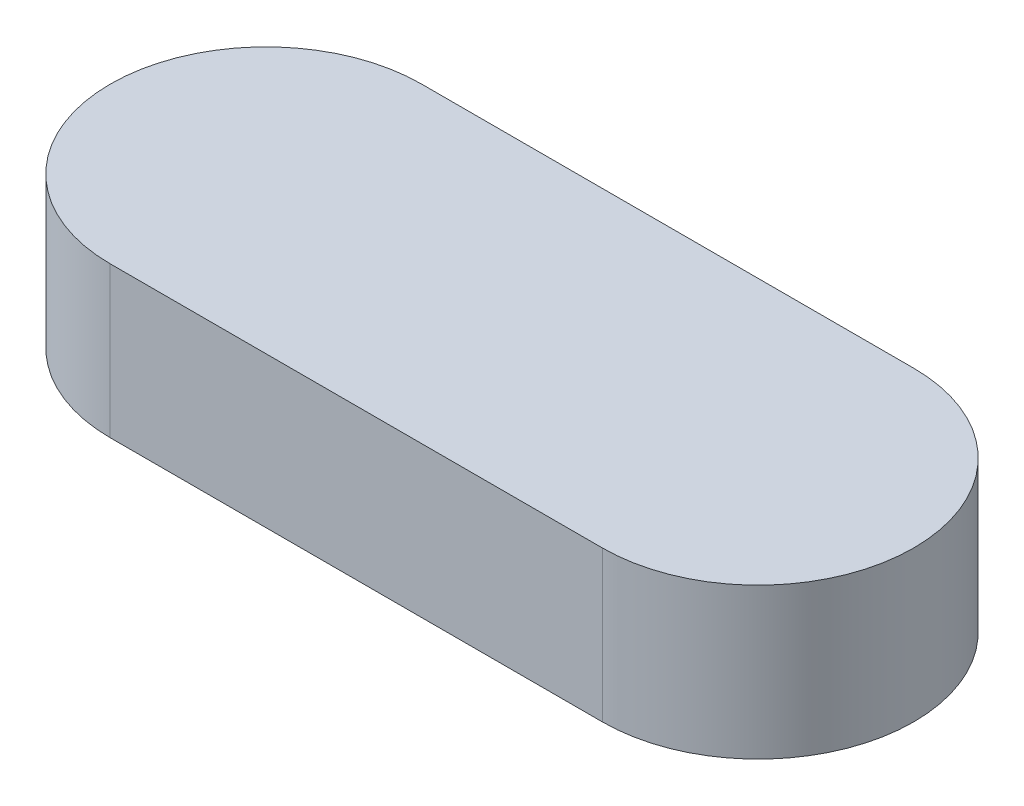
ISO-10303-21;
HEADER;
FILE_DESCRIPTION(('STEP AP214'),'2;1');
FILE_NAME('part.step','',(''),(''),'','','');
FILE_SCHEMA(('AUTOMOTIVE_DESIGN { 1 0 10303 214 1 1 1 1 }'));
ENDSEC;
DATA;
#1=APPLICATION_CONTEXT('core data for automotive mechanical design processes');
#2=APPLICATION_PROTOCOL_DEFINITION('international standard','automotive_design',2000,#1);
#3=PRODUCT_CONTEXT('',#1,'mechanical');
#4=PRODUCT('Part','Part','',(#3));
#5=PRODUCT_RELATED_PRODUCT_CATEGORY('part','',(#4));
#6=PRODUCT_DEFINITION_FORMATION('','',#4);
#7=PRODUCT_DEFINITION_CONTEXT('part definition',#1,'design');
#8=PRODUCT_DEFINITION('design','',#6,#7);
#9=PRODUCT_DEFINITION_SHAPE('','',#8);
#10=(LENGTH_UNIT() NAMED_UNIT(*) SI_UNIT(.MILLI.,.METRE.));
#11=(NAMED_UNIT(*) PLANE_ANGLE_UNIT() SI_UNIT($,.RADIAN.));
#12=(NAMED_UNIT(*) SI_UNIT($,.STERADIAN.) SOLID_ANGLE_UNIT());
#13=UNCERTAINTY_MEASURE_WITH_UNIT(LENGTH_MEASURE(1.E-05),#10,'distance_accuracy_value','');
#14=(GEOMETRIC_REPRESENTATION_CONTEXT(3) GLOBAL_UNCERTAINTY_ASSIGNED_CONTEXT((#13)) GLOBAL_UNIT_ASSIGNED_CONTEXT((#10,
#11,#12)) REPRESENTATION_CONTEXT('',''));
#15=CARTESIAN_POINT('',(0.,0.,0.));
#16=DIRECTION('',(0.,0.,1.));
#17=DIRECTION('',(1.,0.,0.));
#18=AXIS2_PLACEMENT_3D('',#15,#16,#17);
#19=CARTESIAN_POINT('',(-12.25,7.5,0.));
#20=DIRECTION('',(0.,-1.,0.));
#21=DIRECTION('',(0.,0.,-1.));
#22=AXIS2_PLACEMENT_3D('',#19,#20,#21);
#23=CYLINDRICAL_SURFACE('',#22,7.75);
#24=CARTESIAN_POINT('',(-12.25,0.,0.));
#25=DIRECTION('',(0.,1.,0.));
#26=DIRECTION('',(0.,0.,1.));
#27=AXIS2_PLACEMENT_3D('',#24,#25,#26);
#28=CIRCLE('',#27,7.75);
#29=CARTESIAN_POINT('',(-12.25,0.,-7.75));
#30=VERTEX_POINT('',#29);
#31=CARTESIAN_POINT('',(-12.25,0.,7.75));
#32=VERTEX_POINT('',#31);
#33=EDGE_CURVE('E111',#30,#32,#28,.T.);
#34=ORIENTED_EDGE('',*,*,#33,.T.);
#35=DIRECTION('',(0.,-1.,0.));
#36=VECTOR('',#35,1.);
#37=CARTESIAN_POINT('',(-12.25,7.5,7.75));
#38=LINE('',#37,#36);
#39=CARTESIAN_POINT('',(-12.25,7.5,7.75));
#40=VERTEX_POINT('',#39);
#41=EDGE_CURVE('E11',#40,#32,#38,.T.);
#42=ORIENTED_EDGE('',*,*,#41,.F.);
#43=CARTESIAN_POINT('',(-12.25,7.5,0.));
#44=DIRECTION('',(0.,1.,0.));
#45=DIRECTION('',(0.,0.,1.));
#46=AXIS2_PLACEMENT_3D('',#43,#44,#45);
#47=CIRCLE('',#46,7.75);
#48=CARTESIAN_POINT('',(-12.25,7.5,-7.75));
#49=VERTEX_POINT('',#48);
#50=EDGE_CURVE('E95',#49,#40,#47,.T.);
#51=ORIENTED_EDGE('',*,*,#50,.F.);
#52=DIRECTION('',(0.,-1.,0.));
#53=VECTOR('',#52,1.);
#54=CARTESIAN_POINT('',(-12.25,7.5,-7.75));
#55=LINE('',#54,#53);
#56=EDGE_CURVE('E107',#49,#30,#55,.T.);
#57=ORIENTED_EDGE('',*,*,#56,.T.);
#58=EDGE_LOOP('',(#34,#42,#51,#57));
#59=FACE_BOUND('',#58,.T.);
#60=ADVANCED_FACE('F43',(#59),#23,.T.);
#61=CARTESIAN_POINT('',(-12.25,7.5,7.75));
#62=DIRECTION('',(0.,0.,-1.));
#63=DIRECTION('',(-1.,0.,0.));
#64=AXIS2_PLACEMENT_3D('',#61,#62,#63);
#65=PLANE('',#64);
#66=DIRECTION('',(1.,0.,0.));
#67=VECTOR('',#66,1.);
#68=CARTESIAN_POINT('',(-12.25,0.,7.75));
#69=LINE('',#68,#67);
#70=CARTESIAN_POINT('',(12.25,0.,7.75));
#71=VERTEX_POINT('',#70);
#72=EDGE_CURVE('E100',#32,#71,#69,.T.);
#73=ORIENTED_EDGE('',*,*,#72,.T.);
#74=DIRECTION('',(0.,-1.,0.));
#75=VECTOR('',#74,1.);
#76=CARTESIAN_POINT('',(12.25,7.5,7.75));
#77=LINE('',#76,#75);
#78=CARTESIAN_POINT('',(12.25,7.5,7.75));
#79=VERTEX_POINT('',#78);
#80=EDGE_CURVE('E52',#79,#71,#77,.T.);
#81=ORIENTED_EDGE('',*,*,#80,.F.);
#82=DIRECTION('',(1.,0.,0.));
#83=VECTOR('',#82,1.);
#84=CARTESIAN_POINT('',(-12.25,7.5,7.75));
#85=LINE('',#84,#83);
#86=EDGE_CURVE('E90',#40,#79,#85,.T.);
#87=ORIENTED_EDGE('',*,*,#86,.F.);
#88=ORIENTED_EDGE('',*,*,#41,.T.);
#89=EDGE_LOOP('',(#73,#81,#87,#88));
#90=FACE_BOUND('',#89,.T.);
#91=ADVANCED_FACE('F99',(#90),#65,.F.);
#92=CARTESIAN_POINT('',(12.25,7.5,0.));
#93=DIRECTION('',(0.,-1.,0.));
#94=DIRECTION('',(0.,0.,-1.));
#95=AXIS2_PLACEMENT_3D('',#92,#93,#94);
#96=CYLINDRICAL_SURFACE('',#95,7.75);
#97=CARTESIAN_POINT('',(12.25,0.,0.));
#98=DIRECTION('',(0.,1.,0.));
#99=DIRECTION('',(0.,0.,1.));
#100=AXIS2_PLACEMENT_3D('',#97,#98,#99);
#101=CIRCLE('',#100,7.75);
#102=CARTESIAN_POINT('',(12.25,0.,-7.75000000000001));
#103=VERTEX_POINT('',#102);
#104=EDGE_CURVE('E77',#71,#103,#101,.T.);
#105=ORIENTED_EDGE('',*,*,#104,.T.);
#106=DIRECTION('',(0.,-1.,0.));
#107=VECTOR('',#106,1.);
#108=CARTESIAN_POINT('',(12.25,7.5,-7.75000000000001));
#109=LINE('',#108,#107);
#110=CARTESIAN_POINT('',(12.25,7.5,-7.75000000000001));
#111=VERTEX_POINT('',#110);
#112=EDGE_CURVE('E102',#111,#103,#109,.T.);
#113=ORIENTED_EDGE('',*,*,#112,.F.);
#114=CARTESIAN_POINT('',(12.25,7.5,0.));
#115=DIRECTION('',(0.,1.,0.));
#116=DIRECTION('',(0.,0.,1.));
#117=AXIS2_PLACEMENT_3D('',#114,#115,#116);
#118=CIRCLE('',#117,7.75);
#119=EDGE_CURVE('E93',#79,#111,#118,.T.);
#120=ORIENTED_EDGE('',*,*,#119,.F.);
#121=ORIENTED_EDGE('',*,*,#80,.T.);
#122=EDGE_LOOP('',(#105,#113,#120,#121));
#123=FACE_BOUND('',#122,.T.);
#124=ADVANCED_FACE('F103',(#123),#96,.T.);
#125=CARTESIAN_POINT('',(-12.25,7.5,-7.75));
#126=DIRECTION('',(0.,0.,1.));
#127=DIRECTION('',(1.,0.,0.));
#128=AXIS2_PLACEMENT_3D('',#125,#126,#127);
#129=PLANE('',#128);
#130=DIRECTION('',(-1.,0.,0.));
#131=VECTOR('',#130,1.);
#132=CARTESIAN_POINT('',(-12.25,0.,-7.75));
#133=LINE('',#132,#131);
#134=EDGE_CURVE('E83',#103,#30,#133,.T.);
#135=ORIENTED_EDGE('',*,*,#134,.T.);
#136=ORIENTED_EDGE('',*,*,#56,.F.);
#137=DIRECTION('',(-1.,0.,0.));
#138=VECTOR('',#137,1.);
#139=CARTESIAN_POINT('',(-12.25,7.5,-7.75));
#140=LINE('',#139,#138);
#141=EDGE_CURVE('E60',#111,#49,#140,.T.);
#142=ORIENTED_EDGE('',*,*,#141,.F.);
#143=ORIENTED_EDGE('',*,*,#112,.T.);
#144=EDGE_LOOP('',(#135,#136,#142,#143));
#145=FACE_BOUND('',#144,.T.);
#146=ADVANCED_FACE('F124',(#145),#129,.F.);
#147=CARTESIAN_POINT('',(-12.25,7.5,0.));
#148=DIRECTION('',(0.,1.,0.));
#149=DIRECTION('',(0.,0.,1.));
#150=AXIS2_PLACEMENT_3D('',#147,#148,#149);
#151=PLANE('',#150);
#152=ORIENTED_EDGE('',*,*,#50,.T.);
#153=ORIENTED_EDGE('',*,*,#86,.T.);
#154=ORIENTED_EDGE('',*,*,#119,.T.);
#155=ORIENTED_EDGE('',*,*,#141,.T.);
#156=EDGE_LOOP('',(#152,#153,#154,#155));
#157=FACE_BOUND('',#156,.T.);
#158=ADVANCED_FACE('F91',(#157),#151,.T.);
#159=CARTESIAN_POINT('',(-12.25,0.,0.));
#160=DIRECTION('',(0.,1.,0.));
#161=DIRECTION('',(0.,0.,1.));
#162=AXIS2_PLACEMENT_3D('',#159,#160,#161);
#163=PLANE('',#162);
#164=ORIENTED_EDGE('',*,*,#33,.F.);
#165=ORIENTED_EDGE('',*,*,#134,.F.);
#166=ORIENTED_EDGE('',*,*,#104,.F.);
#167=ORIENTED_EDGE('',*,*,#72,.F.);
#168=EDGE_LOOP('',(#164,#165,#166,#167));
#169=FACE_BOUND('',#168,.T.);
#170=ADVANCED_FACE('F127',(#169),#163,.F.);
#171=CLOSED_SHELL('',(#60,#91,#124,#146,#158,#170));
#172=MANIFOLD_SOLID_BREP('B2',#171);
#173=ADVANCED_BREP_SHAPE_REPRESENTATION('',(#18,#172),#14);
#174=SHAPE_DEFINITION_REPRESENTATION(#9,#173);
ENDSEC;
END-ISO-10303-21;
